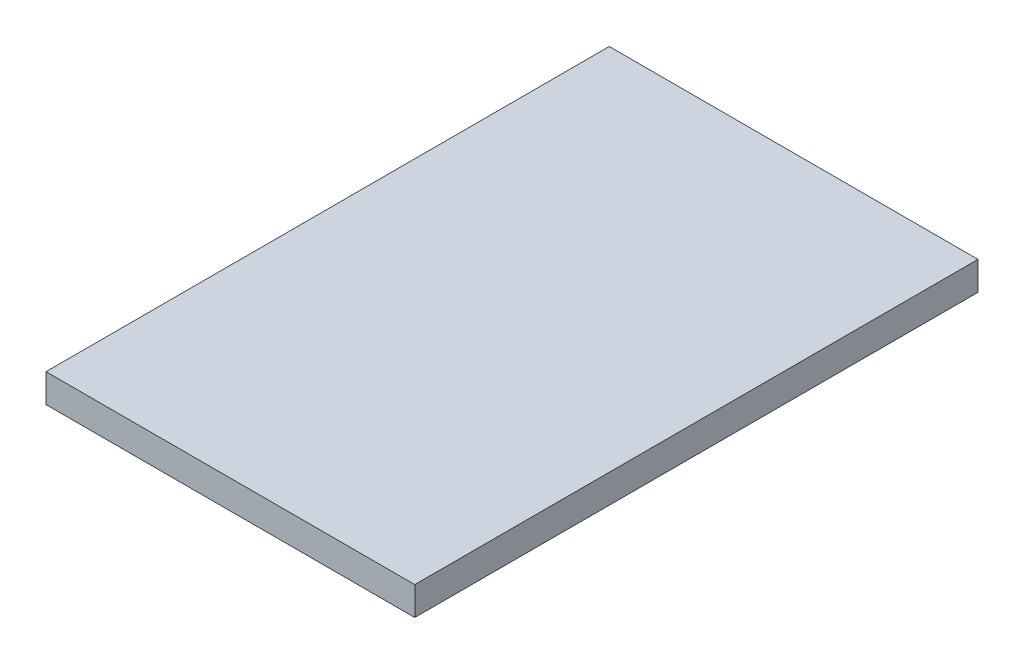
ISO-10303-21;
HEADER;
FILE_DESCRIPTION(('STEP AP214'),'2;1');
FILE_NAME('part.step','',(''),(''),'','','');
FILE_SCHEMA(('AUTOMOTIVE_DESIGN { 1 0 10303 214 1 1 1 1 }'));
ENDSEC;
DATA;
#1=APPLICATION_CONTEXT('core data for automotive mechanical design processes');
#2=APPLICATION_PROTOCOL_DEFINITION('international standard','automotive_design',2000,#1);
#3=PRODUCT_CONTEXT('',#1,'mechanical');
#4=PRODUCT('Part','Part','',(#3));
#5=PRODUCT_RELATED_PRODUCT_CATEGORY('part','',(#4));
#6=PRODUCT_DEFINITION_FORMATION('','',#4);
#7=PRODUCT_DEFINITION_CONTEXT('part definition',#1,'design');
#8=PRODUCT_DEFINITION('design','',#6,#7);
#9=PRODUCT_DEFINITION_SHAPE('','',#8);
#10=(LENGTH_UNIT() NAMED_UNIT(*) SI_UNIT(.MILLI.,.METRE.));
#11=(NAMED_UNIT(*) PLANE_ANGLE_UNIT() SI_UNIT($,.RADIAN.));
#12=(NAMED_UNIT(*) SI_UNIT($,.STERADIAN.) SOLID_ANGLE_UNIT());
#13=UNCERTAINTY_MEASURE_WITH_UNIT(LENGTH_MEASURE(1.E-05),#10,'distance_accuracy_value','');
#14=(GEOMETRIC_REPRESENTATION_CONTEXT(3) GLOBAL_UNCERTAINTY_ASSIGNED_CONTEXT((#13)) GLOBAL_UNIT_ASSIGNED_CONTEXT((#10,
#11,#12)) REPRESENTATION_CONTEXT('',''));
#15=CARTESIAN_POINT('',(0.,0.,0.));
#16=DIRECTION('',(0.,0.,1.));
#17=DIRECTION('',(1.,0.,0.));
#18=AXIS2_PLACEMENT_3D('',#15,#16,#17);
#19=CARTESIAN_POINT('',(0.,4.00000000000402,-21.275));
#20=DIRECTION('',(0.,-1.,0.));
#21=DIRECTION('',(0.,0.,-1.));
#22=AXIS2_PLACEMENT_3D('',#19,#20,#21);
#23=PLANE('',#22);
#24=DIRECTION('',(0.,0.,-1.));
#25=VECTOR('',#24,1.);
#26=CARTESIAN_POINT('',(-6.46507923050827,4.00000000000402,-15.8375));
#27=LINE('',#26,#25);
#28=CARTESIAN_POINT('',(-6.46507923050827,4.00000000000402,-11.4));
#29=VERTEX_POINT('',#28);
#30=CARTESIAN_POINT('',(-6.46507923050827,4.00000000000402,-31.15));
#31=VERTEX_POINT('',#30);
#32=EDGE_CURVE('E27',#29,#31,#27,.T.);
#33=ORIENTED_EDGE('',*,*,#32,.T.);
#34=DIRECTION('',(1.,0.,0.));
#35=VECTOR('',#34,1.);
#36=CARTESIAN_POINT('',(-15.,4.00000000000402,-31.15));
#37=LINE('',#36,#35);
#38=CARTESIAN_POINT('',(6.46507923050827,4.00000000000402,-31.15));
#39=VERTEX_POINT('',#38);
#40=EDGE_CURVE('E85',#31,#39,#37,.T.);
#41=ORIENTED_EDGE('',*,*,#40,.T.);
#42=DIRECTION('',(0.,0.,1.));
#43=VECTOR('',#42,1.);
#44=CARTESIAN_POINT('',(6.46507923050827,4.00000000000402,-15.8375));
#45=LINE('',#44,#43);
#46=CARTESIAN_POINT('',(6.46507923050827,4.00000000000402,-11.4));
#47=VERTEX_POINT('',#46);
#48=EDGE_CURVE('E79',#39,#47,#45,.T.);
#49=ORIENTED_EDGE('',*,*,#48,.T.);
#50=DIRECTION('',(-1.,0.,0.));
#51=VECTOR('',#50,1.);
#52=CARTESIAN_POINT('',(15.,4.00000000000402,-11.4));
#53=LINE('',#52,#51);
#54=EDGE_CURVE('E64',#47,#29,#53,.T.);
#55=ORIENTED_EDGE('',*,*,#54,.T.);
#56=EDGE_LOOP('',(#33,#41,#49,#55));
#57=FACE_BOUND('',#56,.T.);
#58=ADVANCED_FACE('F16',(#57),#23,.T.);
#59=CARTESIAN_POINT('',(0.,5.00000000000402,-21.275));
#60=DIRECTION('',(0.,1.,0.));
#61=DIRECTION('',(1.,0.,0.));
#62=AXIS2_PLACEMENT_3D('',#59,#60,#61);
#63=PLANE('',#62);
#64=DIRECTION('',(0.,0.,1.));
#65=VECTOR('',#64,1.);
#66=CARTESIAN_POINT('',(-6.46507923050827,5.00000000000402,-15.8375));
#67=LINE('',#66,#65);
#68=CARTESIAN_POINT('',(-6.46507923050827,5.00000000000402,-31.15));
#69=VERTEX_POINT('',#68);
#70=CARTESIAN_POINT('',(-6.46507923050827,5.00000000000402,-11.4));
#71=VERTEX_POINT('',#70);
#72=EDGE_CURVE('E11',#69,#71,#67,.T.);
#73=ORIENTED_EDGE('',*,*,#72,.T.);
#74=DIRECTION('',(1.,0.,0.));
#75=VECTOR('',#74,1.);
#76=CARTESIAN_POINT('',(15.,5.00000000000402,-11.4));
#77=LINE('',#76,#75);
#78=CARTESIAN_POINT('',(6.46507923050827,5.00000000000402,-11.4));
#79=VERTEX_POINT('',#78);
#80=EDGE_CURVE('E75',#71,#79,#77,.T.);
#81=ORIENTED_EDGE('',*,*,#80,.T.);
#82=DIRECTION('',(0.,0.,-1.));
#83=VECTOR('',#82,1.);
#84=CARTESIAN_POINT('',(6.46507923050827,5.00000000000402,-15.8375));
#85=LINE('',#84,#83);
#86=CARTESIAN_POINT('',(6.46507923050827,5.00000000000402,-31.15));
#87=VERTEX_POINT('',#86);
#88=EDGE_CURVE('E20',#79,#87,#85,.T.);
#89=ORIENTED_EDGE('',*,*,#88,.T.);
#90=DIRECTION('',(-1.,0.,0.));
#91=VECTOR('',#90,1.);
#92=CARTESIAN_POINT('',(-15.,5.00000000000402,-31.15));
#93=LINE('',#92,#91);
#94=EDGE_CURVE('E92',#87,#69,#93,.T.);
#95=ORIENTED_EDGE('',*,*,#94,.T.);
#96=EDGE_LOOP('',(#73,#81,#89,#95));
#97=FACE_BOUND('',#96,.T.);
#98=ADVANCED_FACE('F193',(#97),#63,.T.);
#99=CARTESIAN_POINT('',(-6.46507923050827,4.00000000000402,-31.15));
#100=DIRECTION('',(-1.,0.,0.));
#101=DIRECTION('',(0.,0.,1.));
#102=AXIS2_PLACEMENT_3D('',#99,#100,#101);
#103=PLANE('',#102);
#104=ORIENTED_EDGE('',*,*,#32,.F.);
#105=DIRECTION('',(0.,1.,0.));
#106=VECTOR('',#105,1.);
#107=CARTESIAN_POINT('',(-6.46507923050827,4.00000000000402,-11.4));
#108=LINE('',#107,#106);
#109=EDGE_CURVE('E70',#29,#71,#108,.T.);
#110=ORIENTED_EDGE('',*,*,#109,.T.);
#111=ORIENTED_EDGE('',*,*,#72,.F.);
#112=DIRECTION('',(0.,1.,0.));
#113=VECTOR('',#112,1.);
#114=CARTESIAN_POINT('',(-6.46507923050827,4.00000000000402,-31.15));
#115=LINE('',#114,#113);
#116=EDGE_CURVE('E97',#31,#69,#115,.T.);
#117=ORIENTED_EDGE('',*,*,#116,.F.);
#118=EDGE_LOOP('',(#104,#110,#111,#117));
#119=FACE_BOUND('',#118,.T.);
#120=ADVANCED_FACE('F184',(#119),#103,.T.);
#121=CARTESIAN_POINT('',(-6.46507923050827,4.00000000000402,-11.4));
#122=DIRECTION('',(0.,0.,1.));
#123=DIRECTION('',(1.,0.,0.));
#124=AXIS2_PLACEMENT_3D('',#121,#122,#123);
#125=PLANE('',#124);
#126=ORIENTED_EDGE('',*,*,#54,.F.);
#127=DIRECTION('',(0.,1.,0.));
#128=VECTOR('',#127,1.);
#129=CARTESIAN_POINT('',(6.46507923050827,4.00000000000402,-11.4));
#130=LINE('',#129,#128);
#131=EDGE_CURVE('E68',#47,#79,#130,.T.);
#132=ORIENTED_EDGE('',*,*,#131,.T.);
#133=ORIENTED_EDGE('',*,*,#80,.F.);
#134=ORIENTED_EDGE('',*,*,#109,.F.);
#135=EDGE_LOOP('',(#126,#132,#133,#134));
#136=FACE_BOUND('',#135,.T.);
#137=ADVANCED_FACE('F66',(#136),#125,.T.);
#138=CARTESIAN_POINT('',(6.46507923050827,4.00000000000402,-11.4));
#139=DIRECTION('',(1.,0.,0.));
#140=DIRECTION('',(0.,1.,0.));
#141=AXIS2_PLACEMENT_3D('',#138,#139,#140);
#142=PLANE('',#141);
#143=ORIENTED_EDGE('',*,*,#48,.F.);
#144=DIRECTION('',(0.,1.,0.));
#145=VECTOR('',#144,1.);
#146=CARTESIAN_POINT('',(6.46507923050827,4.00000000000402,-31.15));
#147=LINE('',#146,#145);
#148=EDGE_CURVE('E87',#39,#87,#147,.T.);
#149=ORIENTED_EDGE('',*,*,#148,.T.);
#150=ORIENTED_EDGE('',*,*,#88,.F.);
#151=ORIENTED_EDGE('',*,*,#131,.F.);
#152=EDGE_LOOP('',(#143,#149,#150,#151));
#153=FACE_BOUND('',#152,.T.);
#154=ADVANCED_FACE('F18',(#153),#142,.T.);
#155=CARTESIAN_POINT('',(6.46507923050827,4.00000000000402,-31.15));
#156=DIRECTION('',(0.,0.,-1.));
#157=DIRECTION('',(0.,-1.,0.));
#158=AXIS2_PLACEMENT_3D('',#155,#156,#157);
#159=PLANE('',#158);
#160=ORIENTED_EDGE('',*,*,#40,.F.);
#161=ORIENTED_EDGE('',*,*,#116,.T.);
#162=ORIENTED_EDGE('',*,*,#94,.F.);
#163=ORIENTED_EDGE('',*,*,#148,.F.);
#164=EDGE_LOOP('',(#160,#161,#162,#163));
#165=FACE_BOUND('',#164,.T.);
#166=ADVANCED_FACE('F156',(#165),#159,.T.);
#167=CLOSED_SHELL('',(#58,#98,#120,#137,#154,#166));
#168=MANIFOLD_SOLID_BREP('B1',#167);
#169=ADVANCED_BREP_SHAPE_REPRESENTATION('',(#18,#168),#14);
#170=SHAPE_DEFINITION_REPRESENTATION(#9,#169);
ENDSEC;
END-ISO-10303-21;
